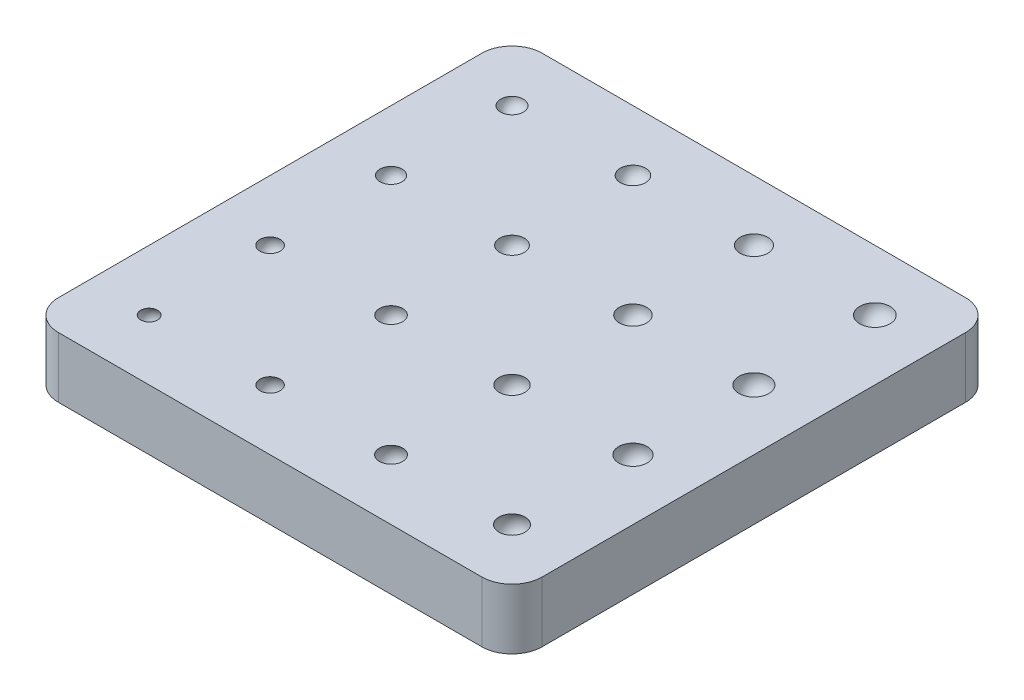
ISO-10303-21;
HEADER;
FILE_DESCRIPTION(('STEP AP214'),'2;1');
FILE_NAME('part.step','',(''),(''),'','','');
FILE_SCHEMA(('AUTOMOTIVE_DESIGN { 1 0 10303 214 1 1 1 1 }'));
ENDSEC;
DATA;
#1=APPLICATION_CONTEXT('core data for automotive mechanical design processes');
#2=APPLICATION_PROTOCOL_DEFINITION('international standard','automotive_design',2000,#1);
#3=PRODUCT_CONTEXT('',#1,'mechanical');
#4=PRODUCT('Part','Part','',(#3));
#5=PRODUCT_RELATED_PRODUCT_CATEGORY('part','',(#4));
#6=PRODUCT_DEFINITION_FORMATION('','',#4);
#7=PRODUCT_DEFINITION_CONTEXT('part definition',#1,'design');
#8=PRODUCT_DEFINITION('design','',#6,#7);
#9=PRODUCT_DEFINITION_SHAPE('','',#8);
#10=(LENGTH_UNIT() NAMED_UNIT(*) SI_UNIT(.MILLI.,.METRE.));
#11=(NAMED_UNIT(*) PLANE_ANGLE_UNIT() SI_UNIT($,.RADIAN.));
#12=(NAMED_UNIT(*) SI_UNIT($,.STERADIAN.) SOLID_ANGLE_UNIT());
#13=UNCERTAINTY_MEASURE_WITH_UNIT(LENGTH_MEASURE(1.E-05),#10,'distance_accuracy_value','');
#14=(GEOMETRIC_REPRESENTATION_CONTEXT(3) GLOBAL_UNCERTAINTY_ASSIGNED_CONTEXT((#13)) GLOBAL_UNIT_ASSIGNED_CONTEXT((#10,
#11,#12)) REPRESENTATION_CONTEXT('',''));
#15=CARTESIAN_POINT('',(0.,0.,0.));
#16=DIRECTION('',(0.,0.,1.));
#17=DIRECTION('',(1.,0.,0.));
#18=AXIS2_PLACEMENT_3D('',#15,#16,#17);
#19=CARTESIAN_POINT('',(50.8,12.7,50.8));
#20=DIRECTION('',(-1.,0.,0.));
#21=DIRECTION('',(0.,0.,1.));
#22=AXIS2_PLACEMENT_3D('',#19,#20,#21);
#23=PLANE('',#22);
#24=DIRECTION('',(0.,0.,-1.));
#25=VECTOR('',#24,1.);
#26=CARTESIAN_POINT('',(50.8,0.,50.8));
#27=LINE('',#26,#25);
#28=CARTESIAN_POINT('',(50.8,0.,44.45));
#29=VERTEX_POINT('',#28);
#30=CARTESIAN_POINT('',(50.8,0.,-44.45));
#31=VERTEX_POINT('',#30);
#32=EDGE_CURVE('E128',#29,#31,#27,.T.);
#33=ORIENTED_EDGE('',*,*,#32,.T.);
#34=DIRECTION('',(0.,-1.,0.));
#35=VECTOR('',#34,1.);
#36=CARTESIAN_POINT('',(50.8,12.7,-44.45));
#37=LINE('',#36,#35);
#38=CARTESIAN_POINT('',(50.8,12.7,-44.45));
#39=VERTEX_POINT('',#38);
#40=EDGE_CURVE('E199',#31,#39,#37,.F.);
#41=ORIENTED_EDGE('',*,*,#40,.T.);
#42=DIRECTION('',(0.,0.,-1.));
#43=VECTOR('',#42,1.);
#44=CARTESIAN_POINT('',(50.8,12.7,50.8));
#45=LINE('',#44,#43);
#46=CARTESIAN_POINT('',(50.8,12.7,44.45));
#47=VERTEX_POINT('',#46);
#48=EDGE_CURVE('E126',#47,#39,#45,.T.);
#49=ORIENTED_EDGE('',*,*,#48,.F.);
#50=DIRECTION('',(0.,-1.,0.));
#51=VECTOR('',#50,1.);
#52=CARTESIAN_POINT('',(50.8,12.7,44.45));
#53=LINE('',#52,#51);
#54=EDGE_CURVE('E196',#47,#29,#53,.T.);
#55=ORIENTED_EDGE('',*,*,#54,.T.);
#56=EDGE_LOOP('',(#33,#41,#49,#55));
#57=FACE_BOUND('',#56,.T.);
#58=ADVANCED_FACE('F33',(#57),#23,.F.);
#59=CARTESIAN_POINT('',(-50.8,12.7,-50.8));
#60=DIRECTION('',(0.,0.,1.));
#61=DIRECTION('',(1.,0.,0.));
#62=AXIS2_PLACEMENT_3D('',#59,#60,#61);
#63=PLANE('',#62);
#64=DIRECTION('',(-1.,0.,0.));
#65=VECTOR('',#64,1.);
#66=CARTESIAN_POINT('',(-50.8,0.,-50.8));
#67=LINE('',#66,#65);
#68=CARTESIAN_POINT('',(44.45,0.,-50.8));
#69=VERTEX_POINT('',#68);
#70=CARTESIAN_POINT('',(-44.45,0.,-50.8));
#71=VERTEX_POINT('',#70);
#72=EDGE_CURVE('E124',#69,#71,#67,.T.);
#73=ORIENTED_EDGE('',*,*,#72,.T.);
#74=DIRECTION('',(0.,-1.,0.));
#75=VECTOR('',#74,1.);
#76=CARTESIAN_POINT('',(-44.45,12.7,-50.8));
#77=LINE('',#76,#75);
#78=CARTESIAN_POINT('',(-44.45,12.7,-50.8));
#79=VERTEX_POINT('',#78);
#80=EDGE_CURVE('E103',#71,#79,#77,.F.);
#81=ORIENTED_EDGE('',*,*,#80,.T.);
#82=DIRECTION('',(-1.,0.,0.));
#83=VECTOR('',#82,1.);
#84=CARTESIAN_POINT('',(-50.8,12.7,-50.8));
#85=LINE('',#84,#83);
#86=CARTESIAN_POINT('',(44.45,12.7,-50.8));
#87=VERTEX_POINT('',#86);
#88=EDGE_CURVE('E215',#87,#79,#85,.T.);
#89=ORIENTED_EDGE('',*,*,#88,.F.);
#90=DIRECTION('',(0.,-1.,0.));
#91=VECTOR('',#90,1.);
#92=CARTESIAN_POINT('',(44.45,12.7,-50.8));
#93=LINE('',#92,#91);
#94=EDGE_CURVE('E108',#87,#69,#93,.T.);
#95=ORIENTED_EDGE('',*,*,#94,.T.);
#96=EDGE_LOOP('',(#73,#81,#89,#95));
#97=FACE_BOUND('',#96,.T.);
#98=ADVANCED_FACE('F237',(#97),#63,.F.);
#99=CARTESIAN_POINT('',(-50.8,12.7,50.8));
#100=DIRECTION('',(1.,0.,0.));
#101=DIRECTION('',(0.,0.,-1.));
#102=AXIS2_PLACEMENT_3D('',#99,#100,#101);
#103=PLANE('',#102);
#104=DIRECTION('',(0.,0.,1.));
#105=VECTOR('',#104,1.);
#106=CARTESIAN_POINT('',(-50.8,12.7,50.8));
#107=LINE('',#106,#105);
#108=CARTESIAN_POINT('',(-50.8,12.7,-44.45));
#109=VERTEX_POINT('',#108);
#110=CARTESIAN_POINT('',(-50.8,12.7,44.45));
#111=VERTEX_POINT('',#110);
#112=EDGE_CURVE('E117',#109,#111,#107,.T.);
#113=ORIENTED_EDGE('',*,*,#112,.F.);
#114=DIRECTION('',(0.,-1.,0.));
#115=VECTOR('',#114,1.);
#116=CARTESIAN_POINT('',(-50.8,12.7,-44.45));
#117=LINE('',#116,#115);
#118=CARTESIAN_POINT('',(-50.8,0.,-44.45));
#119=VERTEX_POINT('',#118);
#120=EDGE_CURVE('E102',#109,#119,#117,.T.);
#121=ORIENTED_EDGE('',*,*,#120,.T.);
#122=DIRECTION('',(0.,0.,1.));
#123=VECTOR('',#122,1.);
#124=CARTESIAN_POINT('',(-50.8,0.,50.8));
#125=LINE('',#124,#123);
#126=CARTESIAN_POINT('',(-50.8,0.,44.45));
#127=VERTEX_POINT('',#126);
#128=EDGE_CURVE('E115',#119,#127,#125,.T.);
#129=ORIENTED_EDGE('',*,*,#128,.T.);
#130=DIRECTION('',(0.,-1.,0.));
#131=VECTOR('',#130,1.);
#132=CARTESIAN_POINT('',(-50.8,12.7,44.45));
#133=LINE('',#132,#131);
#134=EDGE_CURVE('E119',#127,#111,#133,.F.);
#135=ORIENTED_EDGE('',*,*,#134,.T.);
#136=EDGE_LOOP('',(#113,#121,#129,#135));
#137=FACE_BOUND('',#136,.T.);
#138=ADVANCED_FACE('F114',(#137),#103,.F.);
#139=CARTESIAN_POINT('',(-50.8,12.7,50.8));
#140=DIRECTION('',(0.,0.,-1.));
#141=DIRECTION('',(-1.,0.,0.));
#142=AXIS2_PLACEMENT_3D('',#139,#140,#141);
#143=PLANE('',#142);
#144=DIRECTION('',(1.,0.,0.));
#145=VECTOR('',#144,1.);
#146=CARTESIAN_POINT('',(-50.8,0.,50.8));
#147=LINE('',#146,#145);
#148=CARTESIAN_POINT('',(-44.45,0.,50.8));
#149=VERTEX_POINT('',#148);
#150=CARTESIAN_POINT('',(44.45,0.,50.8));
#151=VERTEX_POINT('',#150);
#152=EDGE_CURVE('E123',#149,#151,#147,.T.);
#153=ORIENTED_EDGE('',*,*,#152,.T.);
#154=DIRECTION('',(0.,-1.,0.));
#155=VECTOR('',#154,1.);
#156=CARTESIAN_POINT('',(44.45,12.7,50.8));
#157=LINE('',#156,#155);
#158=CARTESIAN_POINT('',(44.45,12.7,50.8));
#159=VERTEX_POINT('',#158);
#160=EDGE_CURVE('E11',#151,#159,#157,.F.);
#161=ORIENTED_EDGE('',*,*,#160,.T.);
#162=DIRECTION('',(1.,0.,0.));
#163=VECTOR('',#162,1.);
#164=CARTESIAN_POINT('',(-50.8,12.7,50.8));
#165=LINE('',#164,#163);
#166=CARTESIAN_POINT('',(-44.45,12.7,50.8));
#167=VERTEX_POINT('',#166);
#168=EDGE_CURVE('E180',#167,#159,#165,.T.);
#169=ORIENTED_EDGE('',*,*,#168,.F.);
#170=DIRECTION('',(0.,-1.,0.));
#171=VECTOR('',#170,1.);
#172=CARTESIAN_POINT('',(-44.45,12.7,50.8));
#173=LINE('',#172,#171);
#174=EDGE_CURVE('E41',#167,#149,#173,.T.);
#175=ORIENTED_EDGE('',*,*,#174,.T.);
#176=EDGE_LOOP('',(#153,#161,#169,#175));
#177=FACE_BOUND('',#176,.T.);
#178=ADVANCED_FACE('F202',(#177),#143,.F.);
#179=CARTESIAN_POINT('',(0.,12.7,0.));
#180=DIRECTION('',(0.,-1.,0.));
#181=DIRECTION('',(0.,0.,-1.));
#182=AXIS2_PLACEMENT_3D('',#179,#180,#181);
#183=PLANE('',#182);
#184=CARTESIAN_POINT('',(38.1,12.7,38.1));
#185=DIRECTION('',(0.,-1.,0.));
#186=DIRECTION('',(0.,0.,-1.));
#187=AXIS2_PLACEMENT_3D('',#184,#185,#186);
#188=CIRCLE('',#187,2.74963065701559);
#189=CARTESIAN_POINT('',(38.1,12.7,35.3503693429844));
#190=VERTEX_POINT('',#189);
#191=EDGE_CURVE('E177',#190,#190,#188,.F.);
#192=ORIENTED_EDGE('',*,*,#191,.F.);
#193=EDGE_LOOP('',(#192));
#194=FACE_BOUND('',#193,.T.);
#195=CARTESIAN_POINT('',(12.7,12.7,38.1));
#196=DIRECTION('',(0.,-1.,0.));
#197=DIRECTION('',(0.,0.,-1.));
#198=AXIS2_PLACEMENT_3D('',#195,#196,#197);
#199=CIRCLE('',#198,2.43933780432541);
#200=CARTESIAN_POINT('',(12.7,12.7,35.6606621956746));
#201=VERTEX_POINT('',#200);
#202=EDGE_CURVE('E174',#201,#201,#199,.F.);
#203=ORIENTED_EDGE('',*,*,#202,.F.);
#204=EDGE_LOOP('',(#203));
#205=FACE_BOUND('',#204,.T.);
#206=CARTESIAN_POINT('',(-12.7,12.7,38.1));
#207=DIRECTION('',(0.,-1.,0.));
#208=DIRECTION('',(0.,0.,-1.));
#209=AXIS2_PLACEMENT_3D('',#206,#207,#208);
#210=CIRCLE('',#209,2.11666666666667);
#211=CARTESIAN_POINT('',(-12.7,12.7,35.9833333333333));
#212=VERTEX_POINT('',#211);
#213=EDGE_CURVE('E171',#212,#212,#210,.F.);
#214=ORIENTED_EDGE('',*,*,#213,.F.);
#215=EDGE_LOOP('',(#214));
#216=FACE_BOUND('',#215,.T.);
#217=CARTESIAN_POINT('',(38.1,12.7,12.7));
#218=DIRECTION('',(0.,-1.,0.));
#219=DIRECTION('',(0.,0.,-1.));
#220=AXIS2_PLACEMENT_3D('',#217,#218,#219);
#221=CIRCLE('',#220,2.99341870702305);
#222=CARTESIAN_POINT('',(38.1,12.7,9.70658129297695));
#223=VERTEX_POINT('',#222);
#224=EDGE_CURVE('E168',#223,#223,#221,.T.);
#225=ORIENTED_EDGE('',*,*,#224,.T.);
#226=EDGE_LOOP('',(#225));
#227=FACE_BOUND('',#226,.T.);
#228=CARTESIAN_POINT('',(12.7,12.7,12.7));
#229=DIRECTION('',(0.,-1.,0.));
#230=DIRECTION('',(0.,0.,-1.));
#231=AXIS2_PLACEMENT_3D('',#228,#229,#230);
#232=CIRCLE('',#231,2.71117239016014);
#233=CARTESIAN_POINT('',(12.7,12.7,9.98882760983985));
#234=VERTEX_POINT('',#233);
#235=EDGE_CURVE('E165',#234,#234,#232,.T.);
#236=ORIENTED_EDGE('',*,*,#235,.T.);
#237=EDGE_LOOP('',(#236));
#238=FACE_BOUND('',#237,.T.);
#239=CARTESIAN_POINT('',(-12.7,12.7,12.7));
#240=DIRECTION('',(0.,-1.,0.));
#241=DIRECTION('',(0.,0.,-1.));
#242=AXIS2_PLACEMENT_3D('',#239,#240,#241);
#243=CIRCLE('',#242,2.4249463052482);
#244=CARTESIAN_POINT('',(-12.7,12.7,10.2750536947518));
#245=VERTEX_POINT('',#244);
#246=EDGE_CURVE('E162',#245,#245,#243,.F.);
#247=ORIENTED_EDGE('',*,*,#246,.F.);
#248=EDGE_LOOP('',(#247));
#249=FACE_BOUND('',#248,.T.);
#250=CARTESIAN_POINT('',(38.1,12.7,-12.7));
#251=DIRECTION('',(0.,-1.,0.));
#252=DIRECTION('',(0.,0.,-1.));
#253=AXIS2_PLACEMENT_3D('',#250,#251,#252);
#254=CIRCLE('',#253,3.13059221855688);
#255=CARTESIAN_POINT('',(38.1,12.7,-15.8305922185569));
#256=VERTEX_POINT('',#255);
#257=EDGE_CURVE('E159',#256,#256,#254,.F.);
#258=ORIENTED_EDGE('',*,*,#257,.F.);
#259=EDGE_LOOP('',(#258));
#260=FACE_BOUND('',#259,.T.);
#261=CARTESIAN_POINT('',(12.7,12.7,-12.7));
#262=DIRECTION('',(0.,-1.,0.));
#263=DIRECTION('',(0.,0.,-1.));
#264=AXIS2_PLACEMENT_3D('',#261,#262,#263);
#265=CIRCLE('',#264,2.86190632489954);
#266=CARTESIAN_POINT('',(12.7,12.7,-15.5619063248995));
#267=VERTEX_POINT('',#266);
#268=EDGE_CURVE('E156',#267,#267,#265,.T.);
#269=ORIENTED_EDGE('',*,*,#268,.T.);
#270=EDGE_LOOP('',(#269));
#271=FACE_BOUND('',#270,.T.);
#272=CARTESIAN_POINT('',(-12.7,12.7,-12.7));
#273=DIRECTION('',(0.,-1.,0.));
#274=DIRECTION('',(0.,0.,-1.));
#275=AXIS2_PLACEMENT_3D('',#272,#273,#274);
#276=CIRCLE('',#275,2.59237664401347);
#277=CARTESIAN_POINT('',(-12.7,12.7,-15.2923766440135));
#278=VERTEX_POINT('',#277);
#279=EDGE_CURVE('E153',#278,#278,#276,.T.);
#280=ORIENTED_EDGE('',*,*,#279,.T.);
#281=EDGE_LOOP('',(#280));
#282=FACE_BOUND('',#281,.T.);
#283=CARTESIAN_POINT('',(38.1,12.7,-38.1));
#284=DIRECTION('',(0.,-1.,0.));
#285=DIRECTION('',(0.,0.,-1.));
#286=AXIS2_PLACEMENT_3D('',#283,#284,#285);
#287=CIRCLE('',#286,3.175);
#288=CARTESIAN_POINT('',(38.1,12.7,-41.275));
#289=VERTEX_POINT('',#288);
#290=EDGE_CURVE('E150',#289,#289,#287,.T.);
#291=ORIENTED_EDGE('',*,*,#290,.T.);
#292=EDGE_LOOP('',(#291));
#293=FACE_BOUND('',#292,.T.);
#294=CARTESIAN_POINT('',(12.7,12.7,-38.1));
#295=DIRECTION('',(0.,-1.,0.));
#296=DIRECTION('',(0.,0.,-1.));
#297=AXIS2_PLACEMENT_3D('',#294,#295,#296);
#298=CIRCLE('',#297,2.91041666666667);
#299=CARTESIAN_POINT('',(12.7,12.7,-41.0104166666667));
#300=VERTEX_POINT('',#299);
#301=EDGE_CURVE('E147',#300,#300,#298,.T.);
#302=ORIENTED_EDGE('',*,*,#301,.T.);
#303=EDGE_LOOP('',(#302));
#304=FACE_BOUND('',#303,.T.);
#305=CARTESIAN_POINT('',(-12.7,12.7,-38.1));
#306=DIRECTION('',(0.,-1.,0.));
#307=DIRECTION('',(0.,0.,-1.));
#308=AXIS2_PLACEMENT_3D('',#305,#306,#307);
#309=CIRCLE('',#308,2.6458333291);
#310=CARTESIAN_POINT('',(-12.7,12.7,-40.7458333291));
#311=VERTEX_POINT('',#310);
#312=EDGE_CURVE('E144',#311,#311,#309,.T.);
#313=ORIENTED_EDGE('',*,*,#312,.T.);
#314=EDGE_LOOP('',(#313));
#315=FACE_BOUND('',#314,.T.);
#316=CARTESIAN_POINT('',(-38.1,12.7,-12.7));
#317=DIRECTION('',(0.,-1.,0.));
#318=DIRECTION('',(0.,0.,-1.));
#319=AXIS2_PLACEMENT_3D('',#316,#317,#318);
#320=CIRCLE('',#319,2.3217093275168);
#321=CARTESIAN_POINT('',(-38.1,12.7,-15.0217093275168));
#322=VERTEX_POINT('',#321);
#323=EDGE_CURVE('E141',#322,#322,#320,.T.);
#324=ORIENTED_EDGE('',*,*,#323,.T.);
#325=EDGE_LOOP('',(#324));
#326=FACE_BOUND('',#325,.T.);
#327=CARTESIAN_POINT('',(-38.1,12.7,12.7));
#328=DIRECTION('',(0.,-1.,0.));
#329=DIRECTION('',(0.,0.,-1.));
#330=AXIS2_PLACEMENT_3D('',#327,#328,#329);
#331=CIRCLE('',#330,2.13313902923741);
#332=CARTESIAN_POINT('',(-38.1,12.7,10.5668609707626));
#333=VERTEX_POINT('',#332);
#334=EDGE_CURVE('E138',#333,#333,#331,.T.);
#335=ORIENTED_EDGE('',*,*,#334,.T.);
#336=EDGE_LOOP('',(#335));
#337=FACE_BOUND('',#336,.T.);
#338=CARTESIAN_POINT('',(-38.1,12.7,38.1));
#339=DIRECTION('',(0.,-1.,0.));
#340=DIRECTION('',(0.,0.,-1.));
#341=AXIS2_PLACEMENT_3D('',#338,#339,#340);
#342=CIRCLE('',#341,1.77487895714046);
#343=CARTESIAN_POINT('',(-38.1,12.7,36.3251210428595));
#344=VERTEX_POINT('',#343);
#345=EDGE_CURVE('E135',#344,#344,#342,.T.);
#346=ORIENTED_EDGE('',*,*,#345,.T.);
#347=EDGE_LOOP('',(#346));
#348=FACE_BOUND('',#347,.T.);
#349=CARTESIAN_POINT('',(-38.1,12.7,-38.1));
#350=DIRECTION('',(0.,-1.,0.));
#351=DIRECTION('',(0.,0.,-1.));
#352=AXIS2_PLACEMENT_3D('',#349,#350,#351);
#353=CIRCLE('',#352,2.38125);
#354=CARTESIAN_POINT('',(-38.1,12.7,-40.48125));
#355=VERTEX_POINT('',#354);
#356=EDGE_CURVE('E132',#355,#355,#353,.T.);
#357=ORIENTED_EDGE('',*,*,#356,.T.);
#358=EDGE_LOOP('',(#357));
#359=FACE_BOUND('',#358,.T.);
#360=ORIENTED_EDGE('',*,*,#88,.T.);
#361=CARTESIAN_POINT('',(-44.45,12.7,-44.45));
#362=DIRECTION('',(0.,-1.,0.));
#363=DIRECTION('',(0.,0.,-1.));
#364=AXIS2_PLACEMENT_3D('',#361,#362,#363);
#365=CIRCLE('',#364,6.35);
#366=EDGE_CURVE('E194',#79,#109,#365,.F.);
#367=ORIENTED_EDGE('',*,*,#366,.T.);
#368=ORIENTED_EDGE('',*,*,#112,.T.);
#369=CARTESIAN_POINT('',(-44.45,12.7,44.45));
#370=DIRECTION('',(0.,-1.,0.));
#371=DIRECTION('',(0.,0.,-1.));
#372=AXIS2_PLACEMENT_3D('',#369,#370,#371);
#373=CIRCLE('',#372,6.35);
#374=EDGE_CURVE('E53',#111,#167,#373,.F.);
#375=ORIENTED_EDGE('',*,*,#374,.T.);
#376=ORIENTED_EDGE('',*,*,#168,.T.);
#377=CARTESIAN_POINT('',(44.45,12.7,44.45));
#378=DIRECTION('',(0.,-1.,0.));
#379=DIRECTION('',(0.,0.,-1.));
#380=AXIS2_PLACEMENT_3D('',#377,#378,#379);
#381=CIRCLE('',#380,6.35);
#382=EDGE_CURVE('E190',#159,#47,#381,.F.);
#383=ORIENTED_EDGE('',*,*,#382,.T.);
#384=ORIENTED_EDGE('',*,*,#48,.T.);
#385=CARTESIAN_POINT('',(44.45,12.7,-44.45));
#386=DIRECTION('',(0.,-1.,0.));
#387=DIRECTION('',(0.,0.,-1.));
#388=AXIS2_PLACEMENT_3D('',#385,#386,#387);
#389=CIRCLE('',#388,6.35);
#390=EDGE_CURVE('E192',#39,#87,#389,.F.);
#391=ORIENTED_EDGE('',*,*,#390,.T.);
#392=EDGE_LOOP('',(#360,#367,#368,#375,#376,#383,#384,#391));
#393=FACE_BOUND('',#392,.T.);
#394=ADVANCED_FACE('F221',(#194,#205,#216,#227,#238,#249,#260,#271,#282,#293,#304,#315,#326,
#337,#348,#359,#393),#183,.F.);
#395=CARTESIAN_POINT('',(0.,0.,0.));
#396=DIRECTION('',(0.,-1.,0.));
#397=DIRECTION('',(0.,0.,-1.));
#398=AXIS2_PLACEMENT_3D('',#395,#396,#397);
#399=PLANE('',#398);
#400=ORIENTED_EDGE('',*,*,#128,.F.);
#401=CARTESIAN_POINT('',(-44.45,0.,-44.45));
#402=DIRECTION('',(0.,-1.,0.));
#403=DIRECTION('',(0.,0.,-1.));
#404=AXIS2_PLACEMENT_3D('',#401,#402,#403);
#405=CIRCLE('',#404,6.35);
#406=EDGE_CURVE('E98',#119,#71,#405,.T.);
#407=ORIENTED_EDGE('',*,*,#406,.T.);
#408=ORIENTED_EDGE('',*,*,#72,.F.);
#409=CARTESIAN_POINT('',(44.45,0.,-44.45));
#410=DIRECTION('',(0.,-1.,0.));
#411=DIRECTION('',(0.,0.,-1.));
#412=AXIS2_PLACEMENT_3D('',#409,#410,#411);
#413=CIRCLE('',#412,6.35);
#414=EDGE_CURVE('E109',#69,#31,#413,.T.);
#415=ORIENTED_EDGE('',*,*,#414,.T.);
#416=ORIENTED_EDGE('',*,*,#32,.F.);
#417=CARTESIAN_POINT('',(44.45,0.,44.45));
#418=DIRECTION('',(0.,-1.,0.));
#419=DIRECTION('',(0.,0.,-1.));
#420=AXIS2_PLACEMENT_3D('',#417,#418,#419);
#421=CIRCLE('',#420,6.35);
#422=EDGE_CURVE('E183',#29,#151,#421,.T.);
#423=ORIENTED_EDGE('',*,*,#422,.T.);
#424=ORIENTED_EDGE('',*,*,#152,.F.);
#425=CARTESIAN_POINT('',(-44.45,0.,44.45));
#426=DIRECTION('',(0.,-1.,0.));
#427=DIRECTION('',(0.,0.,-1.));
#428=AXIS2_PLACEMENT_3D('',#425,#426,#427);
#429=CIRCLE('',#428,6.35);
#430=EDGE_CURVE('E118',#149,#127,#429,.T.);
#431=ORIENTED_EDGE('',*,*,#430,.T.);
#432=EDGE_LOOP('',(#400,#407,#408,#415,#416,#423,#424,#431));
#433=FACE_BOUND('',#432,.T.);
#434=ADVANCED_FACE('F121',(#433),#399,.T.);
#435=CARTESIAN_POINT('',(-38.1,12.7,-38.1));
#436=DIRECTION('',(0.,1.,0.));
#437=DIRECTION('',(0.,0.,1.));
#438=AXIS2_PLACEMENT_3D('',#435,#436,#437);
#439=SPHERICAL_SURFACE('',#438,2.38125);
#440=ORIENTED_EDGE('',*,*,#356,.F.);
#441=EDGE_LOOP('',(#440));
#442=FACE_BOUND('',#441,.T.);
#443=ADVANCED_FACE('F230',(#442),#439,.F.);
#444=CARTESIAN_POINT('',(-38.1,11.1125,38.1));
#445=DIRECTION('',(0.,-1.,0.));
#446=DIRECTION('',(0.,0.,-1.));
#447=AXIS2_PLACEMENT_3D('',#444,#445,#446);
#448=SPHERICAL_SURFACE('',#447,2.38125);
#449=ORIENTED_EDGE('',*,*,#345,.F.);
#450=EDGE_LOOP('',(#449));
#451=FACE_BOUND('',#450,.T.);
#452=ADVANCED_FACE('F448',(#451),#448,.F.);
#453=CARTESIAN_POINT('',(-38.1,11.6416666666668,12.7));
#454=DIRECTION('',(0.,-1.,0.));
#455=DIRECTION('',(0.,0.,-1.));
#456=AXIS2_PLACEMENT_3D('',#453,#454,#455);
#457=SPHERICAL_SURFACE('',#456,2.38125);
#458=ORIENTED_EDGE('',*,*,#334,.F.);
#459=EDGE_LOOP('',(#458));
#460=FACE_BOUND('',#459,.T.);
#461=ADVANCED_FACE('F438',(#460),#457,.F.);
#462=CARTESIAN_POINT('',(-38.1,12.170833333418,-12.7));
#463=DIRECTION('',(0.,-1.,0.));
#464=DIRECTION('',(0.,0.,-1.));
#465=AXIS2_PLACEMENT_3D('',#462,#463,#464);
#466=SPHERICAL_SURFACE('',#465,2.38125);
#467=ORIENTED_EDGE('',*,*,#323,.F.);
#468=EDGE_LOOP('',(#467));
#469=FACE_BOUND('',#468,.T.);
#470=ADVANCED_FACE('F428',(#469),#466,.F.);
#471=CARTESIAN_POINT('',(-12.7,12.7,-38.1));
#472=DIRECTION('',(0.,1.,0.));
#473=DIRECTION('',(1.,0.,0.));
#474=AXIS2_PLACEMENT_3D('',#471,#472,#473);
#475=SPHERICAL_SURFACE('',#474,2.6458333291);
#476=ORIENTED_EDGE('',*,*,#312,.F.);
#477=EDGE_LOOP('',(#476));
#478=FACE_BOUND('',#477,.T.);
#479=ADVANCED_FACE('F418',(#478),#475,.F.);
#480=CARTESIAN_POINT('',(12.7,12.7,-38.1));
#481=DIRECTION('',(0.,1.,0.));
#482=DIRECTION('',(1.,0.,0.));
#483=AXIS2_PLACEMENT_3D('',#480,#481,#482);
#484=SPHERICAL_SURFACE('',#483,2.91041666666667);
#485=ORIENTED_EDGE('',*,*,#301,.F.);
#486=EDGE_LOOP('',(#485));
#487=FACE_BOUND('',#486,.T.);
#488=ADVANCED_FACE('F408',(#487),#484,.F.);
#489=CARTESIAN_POINT('',(38.1,12.7,-38.1));
#490=DIRECTION('',(0.,1.,0.));
#491=DIRECTION('',(1.,0.,0.));
#492=AXIS2_PLACEMENT_3D('',#489,#490,#491);
#493=SPHERICAL_SURFACE('',#492,3.175);
#494=ORIENTED_EDGE('',*,*,#290,.F.);
#495=EDGE_LOOP('',(#494));
#496=FACE_BOUND('',#495,.T.);
#497=ADVANCED_FACE('F398',(#496),#493,.F.);
#498=CARTESIAN_POINT('',(-12.7,12.1708333333333,-12.7));
#499=DIRECTION('',(0.,-1.,0.));
#500=DIRECTION('',(-1.,0.,0.));
#501=AXIS2_PLACEMENT_3D('',#498,#499,#500);
#502=SPHERICAL_SURFACE('',#501,2.64583333291);
#503=ORIENTED_EDGE('',*,*,#279,.F.);
#504=EDGE_LOOP('',(#503));
#505=FACE_BOUND('',#504,.T.);
#506=ADVANCED_FACE('F388',(#505),#502,.F.);
#507=CARTESIAN_POINT('',(12.7,12.1708333333333,-12.7));
#508=DIRECTION('',(0.,-1.,0.));
#509=DIRECTION('',(-1.,0.,0.));
#510=AXIS2_PLACEMENT_3D('',#507,#508,#509);
#511=SPHERICAL_SURFACE('',#510,2.91041666666667);
#512=ORIENTED_EDGE('',*,*,#268,.F.);
#513=EDGE_LOOP('',(#512));
#514=FACE_BOUND('',#513,.T.);
#515=ADVANCED_FACE('F378',(#514),#511,.F.);
#516=CARTESIAN_POINT('',(38.1,12.1708333333333,-12.7));
#517=DIRECTION('',(0.,1.,0.));
#518=DIRECTION('',(1.,0.,0.));
#519=AXIS2_PLACEMENT_3D('',#516,#517,#518);
#520=SPHERICAL_SURFACE('',#519,3.175);
#521=ORIENTED_EDGE('',*,*,#257,.T.);
#522=EDGE_LOOP('',(#521));
#523=FACE_BOUND('',#522,.T.);
#524=ADVANCED_FACE('F368',(#523),#520,.F.);
#525=CARTESIAN_POINT('',(-12.7,11.6416666666684,12.7));
#526=DIRECTION('',(0.,1.,0.));
#527=DIRECTION('',(1.,0.,0.));
#528=AXIS2_PLACEMENT_3D('',#525,#526,#527);
#529=SPHERICAL_SURFACE('',#528,2.64583333333333);
#530=ORIENTED_EDGE('',*,*,#246,.T.);
#531=EDGE_LOOP('',(#530));
#532=FACE_BOUND('',#531,.T.);
#533=ADVANCED_FACE('F358',(#532),#529,.F.);
#534=CARTESIAN_POINT('',(12.7,11.6416666666667,12.7));
#535=DIRECTION('',(0.,-1.,0.));
#536=DIRECTION('',(-1.,0.,0.));
#537=AXIS2_PLACEMENT_3D('',#534,#535,#536);
#538=SPHERICAL_SURFACE('',#537,2.91041666666667);
#539=ORIENTED_EDGE('',*,*,#235,.F.);
#540=EDGE_LOOP('',(#539));
#541=FACE_BOUND('',#540,.T.);
#542=ADVANCED_FACE('F348',(#541),#538,.F.);
#543=CARTESIAN_POINT('',(38.1,11.6416666666667,12.7));
#544=DIRECTION('',(0.,-1.,0.));
#545=DIRECTION('',(-1.,0.,0.));
#546=AXIS2_PLACEMENT_3D('',#543,#544,#545);
#547=SPHERICAL_SURFACE('',#546,3.175);
#548=ORIENTED_EDGE('',*,*,#224,.F.);
#549=EDGE_LOOP('',(#548));
#550=FACE_BOUND('',#549,.T.);
#551=ADVANCED_FACE('F338',(#550),#547,.F.);
#552=CARTESIAN_POINT('',(-12.7,11.1125,38.1));
#553=DIRECTION('',(0.,1.,0.));
#554=DIRECTION('',(1.,0.,0.));
#555=AXIS2_PLACEMENT_3D('',#552,#553,#554);
#556=SPHERICAL_SURFACE('',#555,2.64583333333333);
#557=ORIENTED_EDGE('',*,*,#213,.T.);
#558=EDGE_LOOP('',(#557));
#559=FACE_BOUND('',#558,.T.);
#560=ADVANCED_FACE('F328',(#559),#556,.F.);
#561=CARTESIAN_POINT('',(12.7,11.1125,38.1));
#562=DIRECTION('',(0.,1.,0.));
#563=DIRECTION('',(-1.,0.,0.));
#564=AXIS2_PLACEMENT_3D('',#561,#562,#563);
#565=SPHERICAL_SURFACE('',#564,2.91041666666667);
#566=ORIENTED_EDGE('',*,*,#202,.T.);
#567=EDGE_LOOP('',(#566));
#568=FACE_BOUND('',#567,.T.);
#569=ADVANCED_FACE('F318',(#568),#565,.F.);
#570=CARTESIAN_POINT('',(38.1,11.1125,38.1));
#571=DIRECTION('',(0.,1.,0.));
#572=DIRECTION('',(1.,0.,0.));
#573=AXIS2_PLACEMENT_3D('',#570,#571,#572);
#574=SPHERICAL_SURFACE('',#573,3.175);
#575=ORIENTED_EDGE('',*,*,#191,.T.);
#576=EDGE_LOOP('',(#575));
#577=FACE_BOUND('',#576,.T.);
#578=ADVANCED_FACE('F249',(#577),#574,.F.);
#579=CARTESIAN_POINT('',(-44.45,12.7,-44.45));
#580=DIRECTION('',(0.,-1.,0.));
#581=DIRECTION('',(0.,0.,-1.));
#582=AXIS2_PLACEMENT_3D('',#579,#580,#581);
#583=CYLINDRICAL_SURFACE('',#582,6.35);
#584=ORIENTED_EDGE('',*,*,#366,.F.);
#585=ORIENTED_EDGE('',*,*,#80,.F.);
#586=ORIENTED_EDGE('',*,*,#406,.F.);
#587=ORIENTED_EDGE('',*,*,#120,.F.);
#588=EDGE_LOOP('',(#584,#585,#586,#587));
#589=FACE_BOUND('',#588,.T.);
#590=ADVANCED_FACE('F101',(#589),#583,.T.);
#591=CARTESIAN_POINT('',(44.45,12.7,-44.45));
#592=DIRECTION('',(0.,-1.,0.));
#593=DIRECTION('',(0.,0.,-1.));
#594=AXIS2_PLACEMENT_3D('',#591,#592,#593);
#595=CYLINDRICAL_SURFACE('',#594,6.35);
#596=ORIENTED_EDGE('',*,*,#390,.F.);
#597=ORIENTED_EDGE('',*,*,#40,.F.);
#598=ORIENTED_EDGE('',*,*,#414,.F.);
#599=ORIENTED_EDGE('',*,*,#94,.F.);
#600=EDGE_LOOP('',(#596,#597,#598,#599));
#601=FACE_BOUND('',#600,.T.);
#602=ADVANCED_FACE('F248',(#601),#595,.T.);
#603=CARTESIAN_POINT('',(44.45,12.7,44.45));
#604=DIRECTION('',(0.,-1.,0.));
#605=DIRECTION('',(0.,0.,-1.));
#606=AXIS2_PLACEMENT_3D('',#603,#604,#605);
#607=CYLINDRICAL_SURFACE('',#606,6.35);
#608=ORIENTED_EDGE('',*,*,#382,.F.);
#609=ORIENTED_EDGE('',*,*,#160,.F.);
#610=ORIENTED_EDGE('',*,*,#422,.F.);
#611=ORIENTED_EDGE('',*,*,#54,.F.);
#612=EDGE_LOOP('',(#608,#609,#610,#611));
#613=FACE_BOUND('',#612,.T.);
#614=ADVANCED_FACE('F209',(#613),#607,.T.);
#615=CARTESIAN_POINT('',(-44.45,12.7,44.45));
#616=DIRECTION('',(0.,-1.,0.));
#617=DIRECTION('',(0.,0.,-1.));
#618=AXIS2_PLACEMENT_3D('',#615,#616,#617);
#619=CYLINDRICAL_SURFACE('',#618,6.35);
#620=ORIENTED_EDGE('',*,*,#374,.F.);
#621=ORIENTED_EDGE('',*,*,#134,.F.);
#622=ORIENTED_EDGE('',*,*,#430,.F.);
#623=ORIENTED_EDGE('',*,*,#174,.F.);
#624=EDGE_LOOP('',(#620,#621,#622,#623));
#625=FACE_BOUND('',#624,.T.);
#626=ADVANCED_FACE('F35',(#625),#619,.T.);
#627=CLOSED_SHELL('',(#58,#98,#138,#178,#394,#434,#443,#452,#461,#470,#479,#488,#497,#506,#515,
#524,#533,#542,#551,#560,#569,#578,#590,#602,#614,#626));
#628=MANIFOLD_SOLID_BREP('B2',#627);
#629=ADVANCED_BREP_SHAPE_REPRESENTATION('',(#18,#628),#14);
#630=SHAPE_DEFINITION_REPRESENTATION(#9,#629);
ENDSEC;
END-ISO-10303-21;
